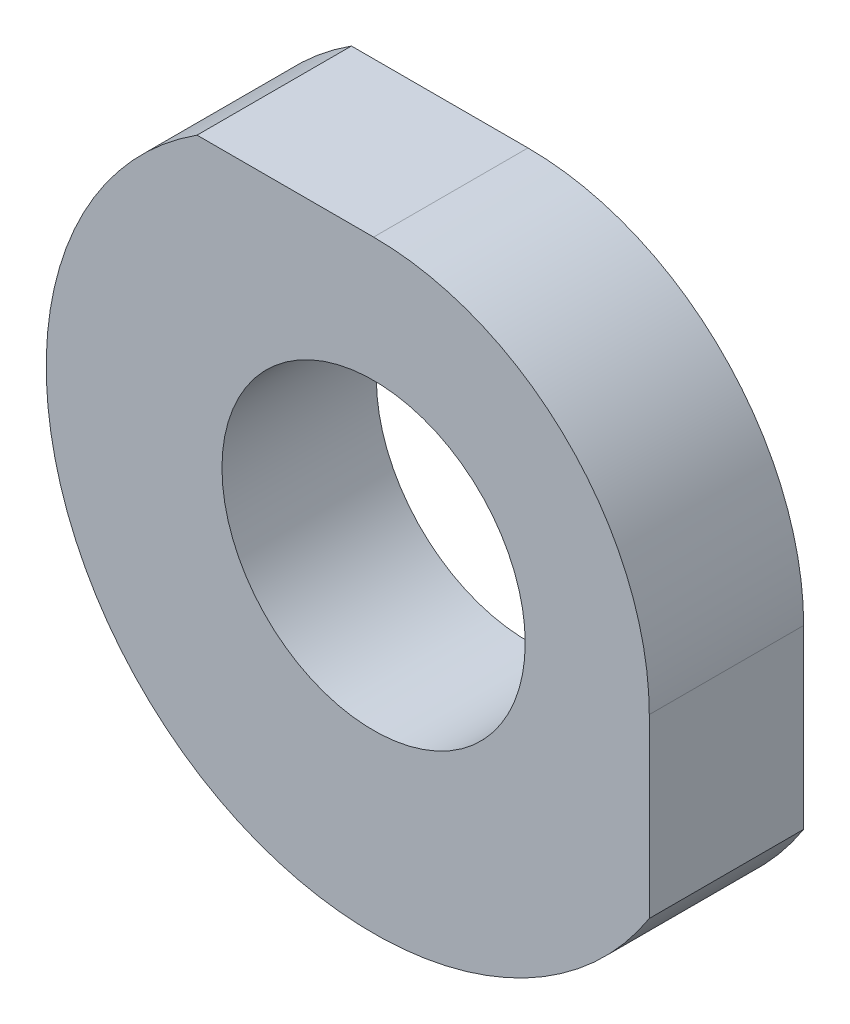
ISO-10303-21;
HEADER;
FILE_DESCRIPTION(('STEP AP214'),'2;1');
FILE_NAME('part.step','',(''),(''),'','','');
FILE_SCHEMA(('AUTOMOTIVE_DESIGN { 1 0 10303 214 1 1 1 1 }'));
ENDSEC;
DATA;
#1=APPLICATION_CONTEXT('core data for automotive mechanical design processes');
#2=APPLICATION_PROTOCOL_DEFINITION('international standard','automotive_design',2000,#1);
#3=PRODUCT_CONTEXT('',#1,'mechanical');
#4=PRODUCT('Part','Part','',(#3));
#5=PRODUCT_RELATED_PRODUCT_CATEGORY('part','',(#4));
#6=PRODUCT_DEFINITION_FORMATION('','',#4);
#7=PRODUCT_DEFINITION_CONTEXT('part definition',#1,'design');
#8=PRODUCT_DEFINITION('design','',#6,#7);
#9=PRODUCT_DEFINITION_SHAPE('','',#8);
#10=(LENGTH_UNIT() NAMED_UNIT(*) SI_UNIT(.MILLI.,.METRE.));
#11=(NAMED_UNIT(*) PLANE_ANGLE_UNIT() SI_UNIT($,.RADIAN.));
#12=(NAMED_UNIT(*) SI_UNIT($,.STERADIAN.) SOLID_ANGLE_UNIT());
#13=UNCERTAINTY_MEASURE_WITH_UNIT(LENGTH_MEASURE(1.E-05),#10,'distance_accuracy_value','');
#14=(GEOMETRIC_REPRESENTATION_CONTEXT(3) GLOBAL_UNCERTAINTY_ASSIGNED_CONTEXT((#13)) GLOBAL_UNIT_ASSIGNED_CONTEXT((#10,
#11,#12)) REPRESENTATION_CONTEXT('',''));
#15=CARTESIAN_POINT('',(0.,0.,0.));
#16=DIRECTION('',(0.,0.,1.));
#17=DIRECTION('',(1.,0.,0.));
#18=AXIS2_PLACEMENT_3D('',#15,#16,#17);
#19=CARTESIAN_POINT('',(10.3125,12.3125,-2.12));
#20=DIRECTION('',(0.,0.,1.));
#21=DIRECTION('',(1.,0.,0.));
#22=AXIS2_PLACEMENT_3D('',#19,#20,#21);
#23=PLANE('',#22);
#24=CARTESIAN_POINT('',(10.5,12.5,-2.12));
#25=DIRECTION('',(0.,0.,1.));
#26=DIRECTION('',(1.,0.,0.));
#27=AXIS2_PLACEMENT_3D('',#24,#25,#26);
#28=CIRCLE('',#27,1.1);
#29=CARTESIAN_POINT('',(9.4,12.5,-2.12));
#30=VERTEX_POINT('',#29);
#31=EDGE_CURVE('E112',#30,#30,#28,.T.);
#32=ORIENTED_EDGE('',*,*,#31,.T.);
#33=EDGE_LOOP('',(#32));
#34=FACE_BOUND('',#33,.T.);
#35=CARTESIAN_POINT('',(10.5,12.5,-2.12));
#36=DIRECTION('',(0.,0.,-1.));
#37=DIRECTION('',(1.,0.,0.));
#38=AXIS2_PLACEMENT_3D('',#35,#36,#37);
#39=CIRCLE('',#38,2.);
#40=CARTESIAN_POINT('',(10.4999985070457,14.4999999999994,-2.12));
#41=VERTEX_POINT('',#40);
#42=CARTESIAN_POINT('',(12.5,12.5,-2.12));
#43=VERTEX_POINT('',#42);
#44=EDGE_CURVE('E90',#41,#43,#39,.T.);
#45=ORIENTED_EDGE('',*,*,#44,.T.);
#46=DIRECTION('',(0.,-1.,0.));
#47=VECTOR('',#46,1.);
#48=CARTESIAN_POINT('',(12.5,15.780868845745,-2.12));
#49=LINE('',#48,#47);
#50=CARTESIAN_POINT('',(12.5000000000002,11.2191311542554,-2.12));
#51=VERTEX_POINT('',#50);
#52=EDGE_CURVE('E25',#43,#51,#49,.T.);
#53=ORIENTED_EDGE('',*,*,#52,.T.);
#54=CARTESIAN_POINT('',(10.5,12.5,-2.12));
#55=DIRECTION('',(0.,0.,-1.));
#56=DIRECTION('',(-0.539313198208399,0.842105263157895,0.));
#57=AXIS2_PLACEMENT_3D('',#54,#55,#56);
#58=CIRCLE('',#57,2.375);
#59=CARTESIAN_POINT('',(9.21913115425505,14.5,-2.12));
#60=VERTEX_POINT('',#59);
#61=EDGE_CURVE('E11',#51,#60,#58,.T.);
#62=ORIENTED_EDGE('',*,*,#61,.T.);
#63=DIRECTION('',(1.,0.,0.));
#64=VECTOR('',#63,1.);
#65=CARTESIAN_POINT('',(-10.5,14.5,-2.12));
#66=LINE('',#65,#64);
#67=EDGE_CURVE('E95',#60,#41,#66,.T.);
#68=ORIENTED_EDGE('',*,*,#67,.T.);
#69=EDGE_LOOP('',(#45,#53,#62,#68));
#70=FACE_BOUND('',#69,.T.);
#71=ADVANCED_FACE('F16',(#34,#70),#23,.F.);
#72=CARTESIAN_POINT('',(10.5,12.5,-1.));
#73=DIRECTION('',(0.,0.,-1.));
#74=DIRECTION('',(-0.707106781186485,-0.70710678118661,0.));
#75=AXIS2_PLACEMENT_3D('',#72,#73,#74);
#76=CYLINDRICAL_SURFACE('',#75,2.375);
#77=CARTESIAN_POINT('',(10.5,12.5,-1.));
#78=DIRECTION('',(0.,0.,1.));
#79=DIRECTION('',(-0.539313198208399,0.842105263157895,0.));
#80=AXIS2_PLACEMENT_3D('',#77,#78,#79);
#81=CIRCLE('',#80,2.375);
#82=CARTESIAN_POINT('',(9.21913115425505,14.5,-1.));
#83=VERTEX_POINT('',#82);
#84=CARTESIAN_POINT('',(12.5000000000002,11.2191311542554,-1.));
#85=VERTEX_POINT('',#84);
#86=EDGE_CURVE('E122',#83,#85,#81,.T.);
#87=ORIENTED_EDGE('',*,*,#86,.F.);
#88=DIRECTION('',(0.,0.,-1.));
#89=VECTOR('',#88,1.);
#90=CARTESIAN_POINT('',(9.21913115425505,14.5,-1.));
#91=LINE('',#90,#89);
#92=EDGE_CURVE('E84',#83,#60,#91,.T.);
#93=ORIENTED_EDGE('',*,*,#92,.T.);
#94=ORIENTED_EDGE('',*,*,#61,.F.);
#95=DIRECTION('',(0.,0.,-1.));
#96=VECTOR('',#95,1.);
#97=CARTESIAN_POINT('',(12.5000000000002,11.2191311542554,-1.));
#98=LINE('',#97,#96);
#99=EDGE_CURVE('E116',#85,#51,#98,.T.);
#100=ORIENTED_EDGE('',*,*,#99,.F.);
#101=EDGE_LOOP('',(#87,#93,#94,#100));
#102=FACE_BOUND('',#101,.T.);
#103=ADVANCED_FACE('F176',(#102),#76,.T.);
#104=CARTESIAN_POINT('',(12.5,12.5,-1.));
#105=DIRECTION('',(1.,0.,0.));
#106=DIRECTION('',(0.,1.,0.));
#107=AXIS2_PLACEMENT_3D('',#104,#105,#106);
#108=PLANE('',#107);
#109=DIRECTION('',(0.,-1.,0.));
#110=VECTOR('',#109,1.);
#111=CARTESIAN_POINT('',(12.5,15.780868845745,-1.));
#112=LINE('',#111,#110);
#113=CARTESIAN_POINT('',(12.5,12.5,-1.));
#114=VERTEX_POINT('',#113);
#115=EDGE_CURVE('E78',#114,#85,#112,.T.);
#116=ORIENTED_EDGE('',*,*,#115,.T.);
#117=ORIENTED_EDGE('',*,*,#99,.T.);
#118=ORIENTED_EDGE('',*,*,#52,.F.);
#119=DIRECTION('',(0.,0.,-1.));
#120=VECTOR('',#119,1.);
#121=CARTESIAN_POINT('',(12.5,12.5,-1.));
#122=LINE('',#121,#120);
#123=EDGE_CURVE('E83',#114,#43,#122,.T.);
#124=ORIENTED_EDGE('',*,*,#123,.F.);
#125=EDGE_LOOP('',(#116,#117,#118,#124));
#126=FACE_BOUND('',#125,.T.);
#127=ADVANCED_FACE('F137',(#126),#108,.T.);
#128=CARTESIAN_POINT('',(10.5,12.5,-1.));
#129=DIRECTION('',(0.,0.,-1.));
#130=DIRECTION('',(1.,0.,0.));
#131=AXIS2_PLACEMENT_3D('',#128,#129,#130);
#132=CYLINDRICAL_SURFACE('',#131,1.1);
#133=ORIENTED_EDGE('',*,*,#31,.F.);
#134=DIRECTION('',(0.,0.,1.));
#135=VECTOR('',#134,1.);
#136=CARTESIAN_POINT('',(9.4,12.5,-1.));
#137=LINE('',#136,#135);
#138=CARTESIAN_POINT('',(9.4,12.5,-1.));
#139=VERTEX_POINT('',#138);
#140=EDGE_CURVE('E113',#30,#139,#137,.T.);
#141=ORIENTED_EDGE('',*,*,#140,.T.);
#142=CARTESIAN_POINT('',(10.5,12.5,-1.));
#143=DIRECTION('',(0.,0.,-1.));
#144=DIRECTION('',(1.,0.,0.));
#145=AXIS2_PLACEMENT_3D('',#142,#143,#144);
#146=CIRCLE('',#145,1.1);
#147=EDGE_CURVE('E109',#139,#139,#146,.T.);
#148=ORIENTED_EDGE('',*,*,#147,.F.);
#149=ORIENTED_EDGE('',*,*,#140,.F.);
#150=EDGE_LOOP('',(#133,#141,#148,#149));
#151=FACE_BOUND('',#150,.T.);
#152=ADVANCED_FACE('F268',(#151),#132,.F.);
#153=CARTESIAN_POINT('',(10.3125,12.3125,-1.));
#154=DIRECTION('',(0.,0.,1.));
#155=DIRECTION('',(1.,0.,0.));
#156=AXIS2_PLACEMENT_3D('',#153,#154,#155);
#157=PLANE('',#156);
#158=ORIENTED_EDGE('',*,*,#147,.T.);
#159=EDGE_LOOP('',(#158));
#160=FACE_BOUND('',#159,.T.);
#161=CARTESIAN_POINT('',(10.5,12.5,-1.));
#162=DIRECTION('',(0.,0.,1.));
#163=DIRECTION('',(1.,0.,0.));
#164=AXIS2_PLACEMENT_3D('',#161,#162,#163);
#165=CIRCLE('',#164,2.);
#166=CARTESIAN_POINT('',(10.4999985070457,14.4999999999994,-1.));
#167=VERTEX_POINT('',#166);
#168=EDGE_CURVE('E71',#114,#167,#165,.T.);
#169=ORIENTED_EDGE('',*,*,#168,.T.);
#170=DIRECTION('',(1.,0.,0.));
#171=VECTOR('',#170,1.);
#172=CARTESIAN_POINT('',(-10.5,14.5,-1.));
#173=LINE('',#172,#171);
#174=EDGE_CURVE('E76',#83,#167,#173,.T.);
#175=ORIENTED_EDGE('',*,*,#174,.F.);
#176=ORIENTED_EDGE('',*,*,#86,.T.);
#177=ORIENTED_EDGE('',*,*,#115,.F.);
#178=EDGE_LOOP('',(#169,#175,#176,#177));
#179=FACE_BOUND('',#178,.T.);
#180=ADVANCED_FACE('F73',(#160,#179),#157,.T.);
#181=CARTESIAN_POINT('',(10.5,12.5,-1.));
#182=DIRECTION('',(0.,0.,-1.));
#183=DIRECTION('',(1.,0.,0.));
#184=AXIS2_PLACEMENT_3D('',#181,#182,#183);
#185=CYLINDRICAL_SURFACE('',#184,2.);
#186=ORIENTED_EDGE('',*,*,#168,.F.);
#187=ORIENTED_EDGE('',*,*,#123,.T.);
#188=ORIENTED_EDGE('',*,*,#44,.F.);
#189=DIRECTION('',(0.,0.,-1.));
#190=VECTOR('',#189,1.);
#191=CARTESIAN_POINT('',(10.4999985070457,14.4999999999994,-1.));
#192=LINE('',#191,#190);
#193=EDGE_CURVE('E87',#167,#41,#192,.T.);
#194=ORIENTED_EDGE('',*,*,#193,.F.);
#195=EDGE_LOOP('',(#186,#187,#188,#194));
#196=FACE_BOUND('',#195,.T.);
#197=ADVANCED_FACE('F88',(#196),#185,.T.);
#198=CARTESIAN_POINT('',(9.21913115425505,14.5,-1.));
#199=DIRECTION('',(0.,1.,0.));
#200=DIRECTION('',(1.,0.,0.));
#201=AXIS2_PLACEMENT_3D('',#198,#199,#200);
#202=PLANE('',#201);
#203=ORIENTED_EDGE('',*,*,#174,.T.);
#204=ORIENTED_EDGE('',*,*,#193,.T.);
#205=ORIENTED_EDGE('',*,*,#67,.F.);
#206=ORIENTED_EDGE('',*,*,#92,.F.);
#207=EDGE_LOOP('',(#203,#204,#205,#206));
#208=FACE_BOUND('',#207,.T.);
#209=ADVANCED_FACE('F98',(#208),#202,.T.);
#210=CLOSED_SHELL('',(#71,#103,#127,#152,#180,#197,#209));
#211=MANIFOLD_SOLID_BREP('B1',#210);
#212=ADVANCED_BREP_SHAPE_REPRESENTATION('',(#18,#211),#14);
#213=SHAPE_DEFINITION_REPRESENTATION(#9,#212);
ENDSEC;
END-ISO-10303-21;
